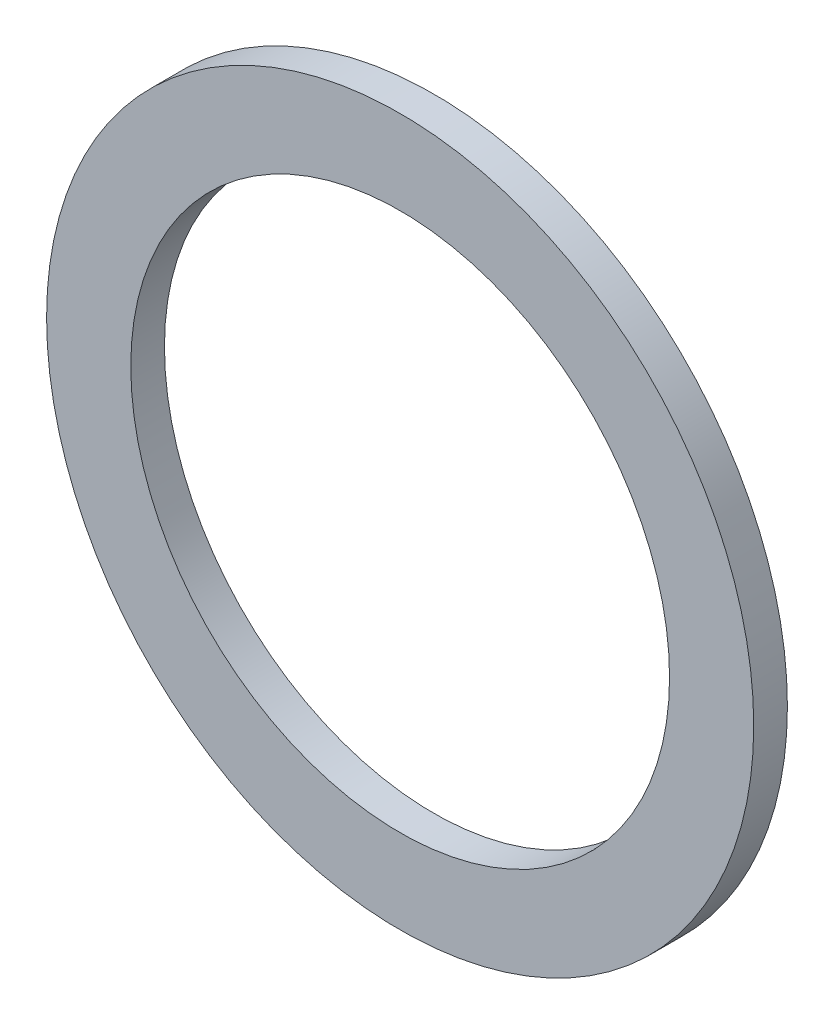
ISO-10303-21;
HEADER;
FILE_DESCRIPTION(('STEP AP214'),'2;1');
FILE_NAME('part.step','',(''),(''),'','','');
FILE_SCHEMA(('AUTOMOTIVE_DESIGN { 1 0 10303 214 1 1 1 1 }'));
ENDSEC;
DATA;
#1=APPLICATION_CONTEXT('core data for automotive mechanical design processes');
#2=APPLICATION_PROTOCOL_DEFINITION('international standard','automotive_design',2000,#1);
#3=PRODUCT_CONTEXT('',#1,'mechanical');
#4=PRODUCT('Part','Part','',(#3));
#5=PRODUCT_RELATED_PRODUCT_CATEGORY('part','',(#4));
#6=PRODUCT_DEFINITION_FORMATION('','',#4);
#7=PRODUCT_DEFINITION_CONTEXT('part definition',#1,'design');
#8=PRODUCT_DEFINITION('design','',#6,#7);
#9=PRODUCT_DEFINITION_SHAPE('','',#8);
#10=(LENGTH_UNIT() NAMED_UNIT(*) SI_UNIT(.MILLI.,.METRE.));
#11=(NAMED_UNIT(*) PLANE_ANGLE_UNIT() SI_UNIT($,.RADIAN.));
#12=(NAMED_UNIT(*) SI_UNIT($,.STERADIAN.) SOLID_ANGLE_UNIT());
#13=UNCERTAINTY_MEASURE_WITH_UNIT(LENGTH_MEASURE(1.E-05),#10,'distance_accuracy_value','');
#14=(GEOMETRIC_REPRESENTATION_CONTEXT(3) GLOBAL_UNCERTAINTY_ASSIGNED_CONTEXT((#13)) GLOBAL_UNIT_ASSIGNED_CONTEXT((#10,
#11,#12)) REPRESENTATION_CONTEXT('',''));
#15=CARTESIAN_POINT('',(0.,0.,0.));
#16=DIRECTION('',(0.,0.,1.));
#17=DIRECTION('',(1.,0.,0.));
#18=AXIS2_PLACEMENT_3D('',#15,#16,#17);
#19=CARTESIAN_POINT('',(0.,0.,0.5));
#20=DIRECTION('',(0.,0.,1.));
#21=DIRECTION('',(1.,0.,0.));
#22=AXIS2_PLACEMENT_3D('',#19,#20,#21);
#23=PLANE('',#22);
#24=CARTESIAN_POINT('',(0.,0.,0.5));
#25=DIRECTION('',(0.,0.,1.));
#26=DIRECTION('',(1.,0.,0.));
#27=AXIS2_PLACEMENT_3D('',#24,#25,#26);
#28=CIRCLE('',#27,10.5);
#29=CARTESIAN_POINT('',(10.5,0.,0.5));
#30=VERTEX_POINT('',#29);
#31=EDGE_CURVE('E10',#30,#30,#28,.T.);
#32=ORIENTED_EDGE('',*,*,#31,.T.);
#33=EDGE_LOOP('',(#32));
#34=FACE_BOUND('',#33,.T.);
#35=CARTESIAN_POINT('',(0.,0.,0.5));
#36=DIRECTION('',(0.,0.,1.));
#37=DIRECTION('',(1.,0.,0.));
#38=AXIS2_PLACEMENT_3D('',#35,#36,#37);
#39=CIRCLE('',#38,8.);
#40=CARTESIAN_POINT('',(8.,0.,0.5));
#41=VERTEX_POINT('',#40);
#42=EDGE_CURVE('E48',#41,#41,#39,.T.);
#43=ORIENTED_EDGE('',*,*,#42,.F.);
#44=EDGE_LOOP('',(#43));
#45=FACE_BOUND('',#44,.T.);
#46=ADVANCED_FACE('F37',(#34,#45),#23,.T.);
#47=CARTESIAN_POINT('',(0.,0.,-0.5));
#48=DIRECTION('',(0.,0.,1.));
#49=DIRECTION('',(1.,0.,0.));
#50=AXIS2_PLACEMENT_3D('',#47,#48,#49);
#51=PLANE('',#50);
#52=CARTESIAN_POINT('',(0.,0.,-0.5));
#53=DIRECTION('',(0.,0.,1.));
#54=DIRECTION('',(1.,0.,0.));
#55=AXIS2_PLACEMENT_3D('',#52,#53,#54);
#56=CIRCLE('',#55,10.5);
#57=CARTESIAN_POINT('',(10.5,0.,-0.5));
#58=VERTEX_POINT('',#57);
#59=EDGE_CURVE('E41',#58,#58,#56,.T.);
#60=ORIENTED_EDGE('',*,*,#59,.F.);
#61=EDGE_LOOP('',(#60));
#62=FACE_BOUND('',#61,.T.);
#63=CARTESIAN_POINT('',(0.,0.,-0.5));
#64=DIRECTION('',(0.,0.,1.));
#65=DIRECTION('',(1.,0.,0.));
#66=AXIS2_PLACEMENT_3D('',#63,#64,#65);
#67=CIRCLE('',#66,8.);
#68=CARTESIAN_POINT('',(8.,0.,-0.5));
#69=VERTEX_POINT('',#68);
#70=EDGE_CURVE('E50',#69,#69,#67,.T.);
#71=ORIENTED_EDGE('',*,*,#70,.T.);
#72=EDGE_LOOP('',(#71));
#73=FACE_BOUND('',#72,.T.);
#74=ADVANCED_FACE('F60',(#62,#73),#51,.F.);
#75=CARTESIAN_POINT('',(0.,0.,0.5));
#76=DIRECTION('',(0.,0.,-1.));
#77=DIRECTION('',(-1.,0.,0.));
#78=AXIS2_PLACEMENT_3D('',#75,#76,#77);
#79=CYLINDRICAL_SURFACE('',#78,10.5);
#80=ORIENTED_EDGE('',*,*,#31,.F.);
#81=EDGE_LOOP('',(#80));
#82=FACE_BOUND('',#81,.T.);
#83=ORIENTED_EDGE('',*,*,#59,.T.);
#84=EDGE_LOOP('',(#83));
#85=FACE_BOUND('',#84,.T.);
#86=ADVANCED_FACE('F39',(#82,#85),#79,.T.);
#87=CARTESIAN_POINT('',(0.,0.,0.5));
#88=DIRECTION('',(0.,0.,-1.));
#89=DIRECTION('',(-1.,0.,0.));
#90=AXIS2_PLACEMENT_3D('',#87,#88,#89);
#91=CYLINDRICAL_SURFACE('',#90,8.);
#92=ORIENTED_EDGE('',*,*,#42,.T.);
#93=EDGE_LOOP('',(#92));
#94=FACE_BOUND('',#93,.T.);
#95=ORIENTED_EDGE('',*,*,#70,.F.);
#96=EDGE_LOOP('',(#95));
#97=FACE_BOUND('',#96,.T.);
#98=ADVANCED_FACE('F56',(#94,#97),#91,.F.);
#99=CLOSED_SHELL('',(#46,#74,#86,#98));
#100=MANIFOLD_SOLID_BREP('B2',#99);
#101=ADVANCED_BREP_SHAPE_REPRESENTATION('',(#18,#100),#14);
#102=SHAPE_DEFINITION_REPRESENTATION(#9,#101);
ENDSEC;
END-ISO-10303-21;
